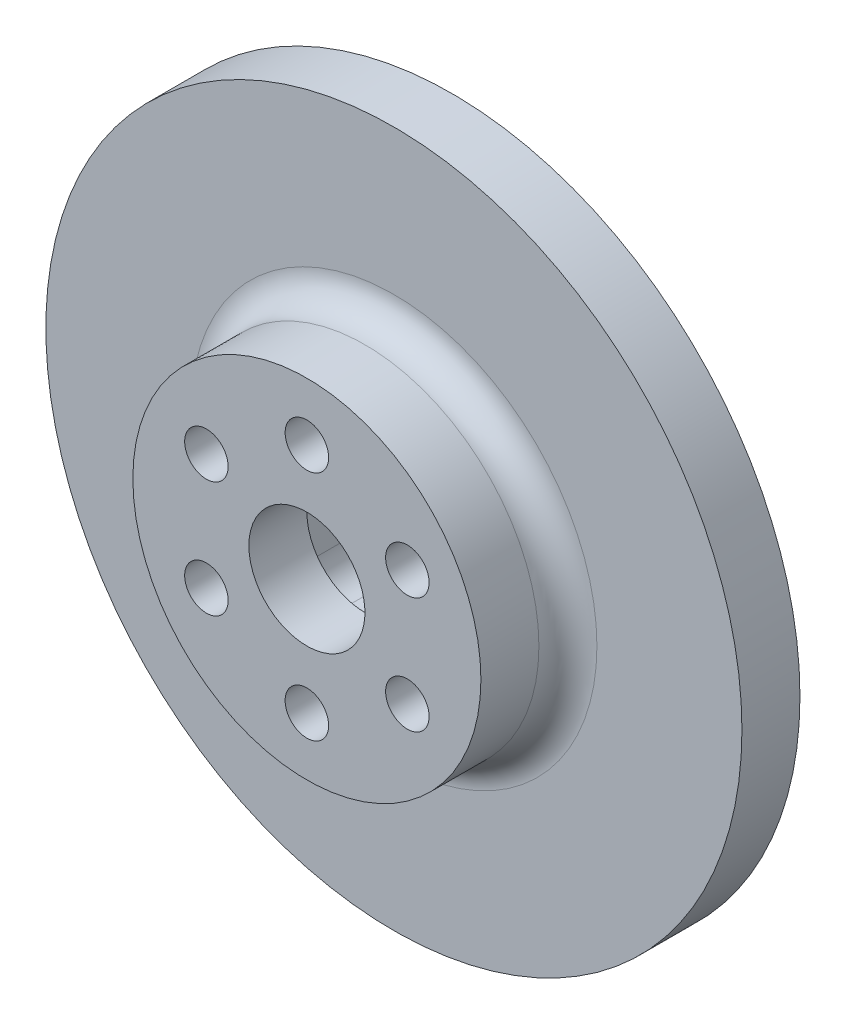
ISO-10303-21;
HEADER;
FILE_DESCRIPTION(('STEP AP214'),'2;1');
FILE_NAME('part.step','',(''),(''),'','','');
FILE_SCHEMA(('AUTOMOTIVE_DESIGN { 1 0 10303 214 1 1 1 1 }'));
ENDSEC;
DATA;
#1=APPLICATION_CONTEXT('core data for automotive mechanical design processes');
#2=APPLICATION_PROTOCOL_DEFINITION('international standard','automotive_design',2000,#1);
#3=PRODUCT_CONTEXT('',#1,'mechanical');
#4=PRODUCT('Part','Part','',(#3));
#5=PRODUCT_RELATED_PRODUCT_CATEGORY('part','',(#4));
#6=PRODUCT_DEFINITION_FORMATION('','',#4);
#7=PRODUCT_DEFINITION_CONTEXT('part definition',#1,'design');
#8=PRODUCT_DEFINITION('design','',#6,#7);
#9=PRODUCT_DEFINITION_SHAPE('','',#8);
#10=(LENGTH_UNIT() NAMED_UNIT(*) SI_UNIT(.MILLI.,.METRE.));
#11=(NAMED_UNIT(*) PLANE_ANGLE_UNIT() SI_UNIT($,.RADIAN.));
#12=(NAMED_UNIT(*) SI_UNIT($,.STERADIAN.) SOLID_ANGLE_UNIT());
#13=UNCERTAINTY_MEASURE_WITH_UNIT(LENGTH_MEASURE(1.E-05),#10,'distance_accuracy_value','');
#14=(GEOMETRIC_REPRESENTATION_CONTEXT(3) GLOBAL_UNCERTAINTY_ASSIGNED_CONTEXT((#13)) GLOBAL_UNIT_ASSIGNED_CONTEXT((#10,
#11,#12)) REPRESENTATION_CONTEXT('',''));
#15=CARTESIAN_POINT('',(0.,0.,0.));
#16=DIRECTION('',(0.,0.,1.));
#17=DIRECTION('',(1.,0.,0.));
#18=AXIS2_PLACEMENT_3D('',#15,#16,#17);
#19=CARTESIAN_POINT('',(0.,0.,6.35));
#20=DIRECTION('',(0.,0.,-1.));
#21=DIRECTION('',(-1.,0.,0.));
#22=AXIS2_PLACEMENT_3D('',#19,#20,#21);
#23=CYLINDRICAL_SURFACE('',#22,38.1);
#24=CARTESIAN_POINT('',(0.,0.,6.35));
#25=DIRECTION('',(0.,0.,1.));
#26=DIRECTION('',(1.,0.,0.));
#27=AXIS2_PLACEMENT_3D('',#24,#25,#26);
#28=CIRCLE('',#27,38.1);
#29=CARTESIAN_POINT('',(38.1,0.,6.35));
#30=VERTEX_POINT('',#29);
#31=EDGE_CURVE('E161',#30,#30,#28,.T.);
#32=ORIENTED_EDGE('',*,*,#31,.F.);
#33=EDGE_LOOP('',(#32));
#34=FACE_BOUND('',#33,.T.);
#35=CARTESIAN_POINT('',(0.,0.,0.));
#36=DIRECTION('',(0.,0.,1.));
#37=DIRECTION('',(1.,0.,0.));
#38=AXIS2_PLACEMENT_3D('',#35,#36,#37);
#39=CIRCLE('',#38,38.1);
#40=CARTESIAN_POINT('',(38.1,0.,0.));
#41=VERTEX_POINT('',#40);
#42=EDGE_CURVE('E160',#41,#41,#39,.T.);
#43=ORIENTED_EDGE('',*,*,#42,.T.);
#44=EDGE_LOOP('',(#43));
#45=FACE_BOUND('',#44,.T.);
#46=ADVANCED_FACE('F36',(#34,#45),#23,.T.);
#47=CARTESIAN_POINT('',(0.,0.,6.35));
#48=DIRECTION('',(0.,0.,1.));
#49=DIRECTION('',(1.,0.,0.));
#50=AXIS2_PLACEMENT_3D('',#47,#48,#49);
#51=PLANE('',#50);
#52=CARTESIAN_POINT('',(0.,-1.01618563327441E-13,6.35));
#53=DIRECTION('',(0.,0.,1.));
#54=DIRECTION('',(1.,0.,0.));
#55=AXIS2_PLACEMENT_3D('',#52,#53,#54);
#56=CIRCLE('',#55,22.225);
#57=CARTESIAN_POINT('',(22.225,-1.01618563327441E-13,6.35));
#58=VERTEX_POINT('',#57);
#59=EDGE_CURVE('E11',#58,#58,#56,.F.);
#60=ORIENTED_EDGE('',*,*,#59,.T.);
#61=EDGE_LOOP('',(#60));
#62=FACE_BOUND('',#61,.T.);
#63=ORIENTED_EDGE('',*,*,#31,.T.);
#64=EDGE_LOOP('',(#63));
#65=FACE_BOUND('',#64,.T.);
#66=ADVANCED_FACE('F187',(#62,#65),#51,.T.);
#67=CARTESIAN_POINT('',(0.,0.,0.));
#68=DIRECTION('',(0.,0.,1.));
#69=DIRECTION('',(1.,0.,0.));
#70=AXIS2_PLACEMENT_3D('',#67,#68,#69);
#71=PLANE('',#70);
#72=DIRECTION('',(-1.,0.,0.));
#73=VECTOR('',#72,1.);
#74=CARTESIAN_POINT('',(4.7625,-9.525,0.));
#75=LINE('',#74,#73);
#76=CARTESIAN_POINT('',(4.7625,-9.525,0.));
#77=VERTEX_POINT('',#76);
#78=CARTESIAN_POINT('',(-4.7625,-9.525,0.));
#79=VERTEX_POINT('',#78);
#80=EDGE_CURVE('E117',#77,#79,#75,.T.);
#81=ORIENTED_EDGE('',*,*,#80,.F.);
#82=CARTESIAN_POINT('',(4.7625,-6.35,0.));
#83=DIRECTION('',(0.,0.,-1.));
#84=DIRECTION('',(1.,0.,0.));
#85=AXIS2_PLACEMENT_3D('',#82,#83,#84);
#86=CIRCLE('',#85,3.175);
#87=CARTESIAN_POINT('',(7.9375,-6.35,0.));
#88=VERTEX_POINT('',#87);
#89=EDGE_CURVE('E51',#88,#77,#86,.T.);
#90=ORIENTED_EDGE('',*,*,#89,.F.);
#91=DIRECTION('',(0.,-1.,0.));
#92=VECTOR('',#91,1.);
#93=CARTESIAN_POINT('',(7.9375,-6.35,0.));
#94=LINE('',#93,#92);
#95=CARTESIAN_POINT('',(7.9375,6.35,0.));
#96=VERTEX_POINT('',#95);
#97=EDGE_CURVE('E139',#96,#88,#94,.T.);
#98=ORIENTED_EDGE('',*,*,#97,.F.);
#99=CARTESIAN_POINT('',(4.7625,6.35,0.));
#100=DIRECTION('',(0.,0.,-1.));
#101=DIRECTION('',(1.,0.,0.));
#102=AXIS2_PLACEMENT_3D('',#99,#100,#101);
#103=CIRCLE('',#102,3.175);
#104=CARTESIAN_POINT('',(4.7625,9.525,0.));
#105=VERTEX_POINT('',#104);
#106=EDGE_CURVE('E136',#105,#96,#103,.T.);
#107=ORIENTED_EDGE('',*,*,#106,.F.);
#108=DIRECTION('',(1.,0.,0.));
#109=VECTOR('',#108,1.);
#110=CARTESIAN_POINT('',(4.7625,9.525,0.));
#111=LINE('',#110,#109);
#112=CARTESIAN_POINT('',(-4.7625,9.525,0.));
#113=VERTEX_POINT('',#112);
#114=EDGE_CURVE('E133',#113,#105,#111,.T.);
#115=ORIENTED_EDGE('',*,*,#114,.F.);
#116=CARTESIAN_POINT('',(-4.7625,6.35,0.));
#117=DIRECTION('',(0.,0.,-1.));
#118=DIRECTION('',(1.,0.,0.));
#119=AXIS2_PLACEMENT_3D('',#116,#117,#118);
#120=CIRCLE('',#119,3.175);
#121=CARTESIAN_POINT('',(-7.9375,6.35,0.));
#122=VERTEX_POINT('',#121);
#123=EDGE_CURVE('E127',#122,#113,#120,.T.);
#124=ORIENTED_EDGE('',*,*,#123,.F.);
#125=DIRECTION('',(0.,1.,0.));
#126=VECTOR('',#125,1.);
#127=CARTESIAN_POINT('',(-7.9375,-6.35,0.));
#128=LINE('',#127,#126);
#129=CARTESIAN_POINT('',(-7.9375,-6.35,0.));
#130=VERTEX_POINT('',#129);
#131=EDGE_CURVE('E125',#130,#122,#128,.T.);
#132=ORIENTED_EDGE('',*,*,#131,.F.);
#133=CARTESIAN_POINT('',(-4.7625,-6.35,0.));
#134=DIRECTION('',(0.,0.,-1.));
#135=DIRECTION('',(-1.,0.,0.));
#136=AXIS2_PLACEMENT_3D('',#133,#134,#135);
#137=CIRCLE('',#136,3.175);
#138=EDGE_CURVE('E108',#79,#130,#137,.T.);
#139=ORIENTED_EDGE('',*,*,#138,.F.);
#140=EDGE_LOOP('',(#81,#90,#98,#107,#115,#124,#132,#139));
#141=FACE_BOUND('',#140,.T.);
#142=ORIENTED_EDGE('',*,*,#42,.F.);
#143=EDGE_LOOP('',(#142));
#144=FACE_BOUND('',#143,.T.);
#145=ADVANCED_FACE('F121',(#141,#144),#71,.F.);
#146=CARTESIAN_POINT('',(0.,-1.01618563327441E-13,69.7565367264149));
#147=DIRECTION('',(0.,0.,-1.));
#148=DIRECTION('',(-1.,0.,0.));
#149=AXIS2_PLACEMENT_3D('',#146,#147,#148);
#150=CYLINDRICAL_SURFACE('',#149,19.05);
#151=CARTESIAN_POINT('',(0.,-1.01618563327441E-13,9.525));
#152=DIRECTION('',(0.,0.,1.));
#153=DIRECTION('',(1.,0.,0.));
#154=AXIS2_PLACEMENT_3D('',#151,#152,#153);
#155=CIRCLE('',#154,19.05);
#156=CARTESIAN_POINT('',(19.05,-1.01618563327441E-13,9.525));
#157=VERTEX_POINT('',#156);
#158=EDGE_CURVE('E44',#157,#157,#155,.T.);
#159=ORIENTED_EDGE('',*,*,#158,.T.);
#160=EDGE_LOOP('',(#159));
#161=FACE_BOUND('',#160,.T.);
#162=CARTESIAN_POINT('',(0.,-1.01618563327441E-13,15.875));
#163=DIRECTION('',(0.,0.,1.));
#164=DIRECTION('',(1.,0.,0.));
#165=AXIS2_PLACEMENT_3D('',#162,#163,#164);
#166=CIRCLE('',#165,19.05);
#167=CARTESIAN_POINT('',(19.05,-1.01618563327441E-13,15.875));
#168=VERTEX_POINT('',#167);
#169=EDGE_CURVE('E156',#168,#168,#166,.T.);
#170=ORIENTED_EDGE('',*,*,#169,.F.);
#171=EDGE_LOOP('',(#170));
#172=FACE_BOUND('',#171,.T.);
#173=ADVANCED_FACE('F168',(#161,#172),#150,.T.);
#174=CARTESIAN_POINT('',(-3.1245635993597E-13,-232.41,15.8749999999999));
#175=DIRECTION('',(0.,0.,1.));
#176=DIRECTION('',(1.,0.,0.));
#177=AXIS2_PLACEMENT_3D('',#174,#175,#176);
#178=PLANE('',#177);
#179=CARTESIAN_POINT('',(0.,12.6999999999998,15.875));
#180=DIRECTION('',(0.,0.,1.));
#181=DIRECTION('',(1.,0.,0.));
#182=AXIS2_PLACEMENT_3D('',#179,#180,#181);
#183=CIRCLE('',#182,2.38125);
#184=CARTESIAN_POINT('',(2.38124999999999,12.6999999999998,15.875));
#185=VERTEX_POINT('',#184);
#186=EDGE_CURVE('E282',#185,#185,#183,.T.);
#187=ORIENTED_EDGE('',*,*,#186,.F.);
#188=EDGE_LOOP('',(#187));
#189=FACE_BOUND('',#188,.T.);
#190=CARTESIAN_POINT('',(-10.9985226280621,6.34999999999997,15.875));
#191=DIRECTION('',(0.,0.,1.));
#192=DIRECTION('',(1.,0.,0.));
#193=AXIS2_PLACEMENT_3D('',#190,#191,#192);
#194=CIRCLE('',#193,2.38125000000212);
#195=CARTESIAN_POINT('',(-8.61727262805997,6.34999999999997,15.875));
#196=VERTEX_POINT('',#195);
#197=EDGE_CURVE('E295',#196,#196,#194,.T.);
#198=ORIENTED_EDGE('',*,*,#197,.F.);
#199=EDGE_LOOP('',(#198));
#200=FACE_BOUND('',#199,.T.);
#201=CARTESIAN_POINT('',(-10.9985226280621,-6.34999999999967,15.875));
#202=DIRECTION('',(0.,0.,1.));
#203=DIRECTION('',(1.,0.,0.));
#204=AXIS2_PLACEMENT_3D('',#201,#202,#203);
#205=CIRCLE('',#204,2.3812500000128);
#206=CARTESIAN_POINT('',(-8.6172726280493,-6.34999999999967,15.875));
#207=VERTEX_POINT('',#206);
#208=EDGE_CURVE('E294',#207,#207,#205,.T.);
#209=ORIENTED_EDGE('',*,*,#208,.F.);
#210=EDGE_LOOP('',(#209));
#211=FACE_BOUND('',#210,.T.);
#212=CARTESIAN_POINT('',(0.,-12.6999999999995,15.875));
#213=DIRECTION('',(0.,0.,1.));
#214=DIRECTION('',(1.,0.,0.));
#215=AXIS2_PLACEMENT_3D('',#212,#213,#214);
#216=CIRCLE('',#215,2.38125000002138);
#217=CARTESIAN_POINT('',(2.38125000002134,-12.6999999999995,15.875));
#218=VERTEX_POINT('',#217);
#219=EDGE_CURVE('E312',#218,#218,#216,.T.);
#220=ORIENTED_EDGE('',*,*,#219,.F.);
#221=EDGE_LOOP('',(#220));
#222=FACE_BOUND('',#221,.T.);
#223=CARTESIAN_POINT('',(10.998522628062,-6.34999999999969,15.875));
#224=DIRECTION('',(0.,0.,1.));
#225=DIRECTION('',(1.,0.,0.));
#226=AXIS2_PLACEMENT_3D('',#223,#224,#225);
#227=CIRCLE('',#226,2.38125000001927);
#228=CARTESIAN_POINT('',(13.3797726280813,-6.34999999999969,15.875));
#229=VERTEX_POINT('',#228);
#230=EDGE_CURVE('E306',#229,#229,#227,.T.);
#231=ORIENTED_EDGE('',*,*,#230,.F.);
#232=EDGE_LOOP('',(#231));
#233=FACE_BOUND('',#232,.T.);
#234=CARTESIAN_POINT('',(10.998522628062,6.34999999999995,15.875));
#235=DIRECTION('',(0.,0.,1.));
#236=DIRECTION('',(1.,0.,0.));
#237=AXIS2_PLACEMENT_3D('',#234,#235,#236);
#238=CIRCLE('',#237,2.38125000000858);
#239=CARTESIAN_POINT('',(13.3797726280706,6.34999999999995,15.875));
#240=VERTEX_POINT('',#239);
#241=EDGE_CURVE('E300',#240,#240,#238,.T.);
#242=ORIENTED_EDGE('',*,*,#241,.F.);
#243=EDGE_LOOP('',(#242));
#244=FACE_BOUND('',#243,.T.);
#245=CARTESIAN_POINT('',(0.,1.42713537823228E-13,15.8750000000001));
#246=DIRECTION('',(0.,0.,-1.));
#247=DIRECTION('',(-1.,0.,0.));
#248=AXIS2_PLACEMENT_3D('',#245,#246,#247);
#249=CIRCLE('',#248,6.34999999999991);
#250=CARTESIAN_POINT('',(-6.34999999999993,1.42713537823228E-13,15.875));
#251=VERTEX_POINT('',#250);
#252=EDGE_CURVE('E285',#251,#251,#249,.T.);
#253=ORIENTED_EDGE('',*,*,#252,.T.);
#254=EDGE_LOOP('',(#253));
#255=FACE_BOUND('',#254,.T.);
#256=ORIENTED_EDGE('',*,*,#169,.T.);
#257=EDGE_LOOP('',(#256));
#258=FACE_BOUND('',#257,.T.);
#259=ADVANCED_FACE('F199',(#189,#200,#211,#222,#233,#244,#255,#258),#178,.T.);
#260=CARTESIAN_POINT('',(4.7625,-6.35,34.3225427210037));
#261=DIRECTION('',(0.,0.,-1.));
#262=DIRECTION('',(-1.,0.,0.));
#263=AXIS2_PLACEMENT_3D('',#260,#261,#262);
#264=CYLINDRICAL_SURFACE('',#263,3.175);
#265=CARTESIAN_POINT('',(4.7625,-6.35,9.52500000000003));
#266=DIRECTION('',(0.,0.,-1.));
#267=DIRECTION('',(-1.,0.,0.));
#268=AXIS2_PLACEMENT_3D('',#265,#266,#267);
#269=CIRCLE('',#268,3.175);
#270=CARTESIAN_POINT('',(4.7625,-9.525,9.52500000000003));
#271=VERTEX_POINT('',#270);
#272=CARTESIAN_POINT('',(7.9375,-6.35,9.52500000000003));
#273=VERTEX_POINT('',#272);
#274=EDGE_CURVE('E157',#271,#273,#269,.F.);
#275=ORIENTED_EDGE('',*,*,#274,.T.);
#276=DIRECTION('',(0.,0.,-1.));
#277=VECTOR('',#276,1.);
#278=CARTESIAN_POINT('',(7.9375,-6.35,34.3225427210037));
#279=LINE('',#278,#277);
#280=EDGE_CURVE('E142',#273,#88,#279,.T.);
#281=ORIENTED_EDGE('',*,*,#280,.T.);
#282=ORIENTED_EDGE('',*,*,#89,.T.);
#283=DIRECTION('',(0.,0.,-1.));
#284=VECTOR('',#283,1.);
#285=CARTESIAN_POINT('',(4.7625,-9.525,34.3225427210037));
#286=LINE('',#285,#284);
#287=EDGE_CURVE('E114',#271,#77,#286,.T.);
#288=ORIENTED_EDGE('',*,*,#287,.F.);
#289=EDGE_LOOP('',(#275,#281,#282,#288));
#290=FACE_BOUND('',#289,.T.);
#291=ADVANCED_FACE('F202',(#290),#264,.F.);
#292=CARTESIAN_POINT('',(7.9375,-6.35,34.3225427210037));
#293=DIRECTION('',(1.,0.,0.));
#294=DIRECTION('',(0.,1.,0.));
#295=AXIS2_PLACEMENT_3D('',#292,#293,#294);
#296=PLANE('',#295);
#297=DIRECTION('',(0.,1.,0.));
#298=VECTOR('',#297,1.);
#299=CARTESIAN_POINT('',(7.9375,-6.35000000000002,9.52500000000003));
#300=LINE('',#299,#298);
#301=CARTESIAN_POINT('',(7.9375,6.35,9.52500000000002));
#302=VERTEX_POINT('',#301);
#303=EDGE_CURVE('E330',#273,#302,#300,.T.);
#304=ORIENTED_EDGE('',*,*,#303,.T.);
#305=DIRECTION('',(0.,0.,-1.));
#306=VECTOR('',#305,1.);
#307=CARTESIAN_POINT('',(7.9375,6.35,34.3225427210037));
#308=LINE('',#307,#306);
#309=EDGE_CURVE('E144',#302,#96,#308,.T.);
#310=ORIENTED_EDGE('',*,*,#309,.T.);
#311=ORIENTED_EDGE('',*,*,#97,.T.);
#312=ORIENTED_EDGE('',*,*,#280,.F.);
#313=EDGE_LOOP('',(#304,#310,#311,#312));
#314=FACE_BOUND('',#313,.T.);
#315=ADVANCED_FACE('F208',(#314),#296,.F.);
#316=CARTESIAN_POINT('',(4.7625,6.35,34.3225427210037));
#317=DIRECTION('',(0.,0.,-1.));
#318=DIRECTION('',(-1.,0.,0.));
#319=AXIS2_PLACEMENT_3D('',#316,#317,#318);
#320=CYLINDRICAL_SURFACE('',#319,3.175);
#321=CARTESIAN_POINT('',(4.7625,6.35,9.52500000000002));
#322=DIRECTION('',(0.,0.,-1.));
#323=DIRECTION('',(-1.,0.,0.));
#324=AXIS2_PLACEMENT_3D('',#321,#322,#323);
#325=CIRCLE('',#324,3.175);
#326=CARTESIAN_POINT('',(4.7625,9.525,9.52500000000002));
#327=VERTEX_POINT('',#326);
#328=EDGE_CURVE('E328',#302,#327,#325,.F.);
#329=ORIENTED_EDGE('',*,*,#328,.T.);
#330=DIRECTION('',(0.,0.,-1.));
#331=VECTOR('',#330,1.);
#332=CARTESIAN_POINT('',(4.7625,9.525,34.3225427210037));
#333=LINE('',#332,#331);
#334=EDGE_CURVE('E146',#327,#105,#333,.T.);
#335=ORIENTED_EDGE('',*,*,#334,.T.);
#336=ORIENTED_EDGE('',*,*,#106,.T.);
#337=ORIENTED_EDGE('',*,*,#309,.F.);
#338=EDGE_LOOP('',(#329,#335,#336,#337));
#339=FACE_BOUND('',#338,.T.);
#340=ADVANCED_FACE('F223',(#339),#320,.F.);
#341=CARTESIAN_POINT('',(4.7625,9.525,34.3225427210037));
#342=DIRECTION('',(0.,1.,0.));
#343=DIRECTION('',(-1.,0.,0.));
#344=AXIS2_PLACEMENT_3D('',#341,#342,#343);
#345=PLANE('',#344);
#346=DIRECTION('',(-1.,0.,0.));
#347=VECTOR('',#346,1.);
#348=CARTESIAN_POINT('',(4.76250000000003,9.525,9.52500000000002));
#349=LINE('',#348,#347);
#350=CARTESIAN_POINT('',(-4.7625,9.525,9.52500000000001));
#351=VERTEX_POINT('',#350);
#352=EDGE_CURVE('E326',#327,#351,#349,.T.);
#353=ORIENTED_EDGE('',*,*,#352,.T.);
#354=DIRECTION('',(0.,0.,-1.));
#355=VECTOR('',#354,1.);
#356=CARTESIAN_POINT('',(-4.7625,9.525,34.3225427210037));
#357=LINE('',#356,#355);
#358=EDGE_CURVE('E148',#351,#113,#357,.T.);
#359=ORIENTED_EDGE('',*,*,#358,.T.);
#360=ORIENTED_EDGE('',*,*,#114,.T.);
#361=ORIENTED_EDGE('',*,*,#334,.F.);
#362=EDGE_LOOP('',(#353,#359,#360,#361));
#363=FACE_BOUND('',#362,.T.);
#364=ADVANCED_FACE('F219',(#363),#345,.F.);
#365=CARTESIAN_POINT('',(-4.7625,6.35,34.3225427210037));
#366=DIRECTION('',(0.,0.,-1.));
#367=DIRECTION('',(-1.,0.,0.));
#368=AXIS2_PLACEMENT_3D('',#365,#366,#367);
#369=CYLINDRICAL_SURFACE('',#368,3.175);
#370=CARTESIAN_POINT('',(-4.7625,6.35,9.52500000000001));
#371=DIRECTION('',(0.,0.,-1.));
#372=DIRECTION('',(-1.,0.,0.));
#373=AXIS2_PLACEMENT_3D('',#370,#371,#372);
#374=CIRCLE('',#373,3.175);
#375=CARTESIAN_POINT('',(-7.9375,6.35,9.525));
#376=VERTEX_POINT('',#375);
#377=EDGE_CURVE('E324',#351,#376,#374,.F.);
#378=ORIENTED_EDGE('',*,*,#377,.T.);
#379=DIRECTION('',(0.,0.,-1.));
#380=VECTOR('',#379,1.);
#381=CARTESIAN_POINT('',(-7.9375,6.35,34.3225427210037));
#382=LINE('',#381,#380);
#383=EDGE_CURVE('E150',#376,#122,#382,.T.);
#384=ORIENTED_EDGE('',*,*,#383,.T.);
#385=ORIENTED_EDGE('',*,*,#123,.T.);
#386=ORIENTED_EDGE('',*,*,#358,.F.);
#387=EDGE_LOOP('',(#378,#384,#385,#386));
#388=FACE_BOUND('',#387,.T.);
#389=ADVANCED_FACE('F216',(#388),#369,.F.);
#390=CARTESIAN_POINT('',(-7.9375,-6.35,34.3225427210037));
#391=DIRECTION('',(-1.,0.,0.));
#392=DIRECTION('',(0.,0.,1.));
#393=AXIS2_PLACEMENT_3D('',#390,#391,#392);
#394=PLANE('',#393);
#395=DIRECTION('',(0.,-1.,0.));
#396=VECTOR('',#395,1.);
#397=CARTESIAN_POINT('',(-7.9375,-6.35000000000002,9.52500000000001));
#398=LINE('',#397,#396);
#399=CARTESIAN_POINT('',(-7.9375,-6.35,9.52500000000001));
#400=VERTEX_POINT('',#399);
#401=EDGE_CURVE('E59',#376,#400,#398,.T.);
#402=ORIENTED_EDGE('',*,*,#401,.T.);
#403=DIRECTION('',(0.,0.,-1.));
#404=VECTOR('',#403,1.);
#405=CARTESIAN_POINT('',(-7.9375,-6.35,34.3225427210037));
#406=LINE('',#405,#404);
#407=EDGE_CURVE('E113',#400,#130,#406,.T.);
#408=ORIENTED_EDGE('',*,*,#407,.T.);
#409=ORIENTED_EDGE('',*,*,#131,.T.);
#410=ORIENTED_EDGE('',*,*,#383,.F.);
#411=EDGE_LOOP('',(#402,#408,#409,#410));
#412=FACE_BOUND('',#411,.T.);
#413=ADVANCED_FACE('F213',(#412),#394,.F.);
#414=CARTESIAN_POINT('',(-4.7625,-6.35,34.3225427210037));
#415=DIRECTION('',(0.,0.,-1.));
#416=DIRECTION('',(-1.,0.,0.));
#417=AXIS2_PLACEMENT_3D('',#414,#415,#416);
#418=CYLINDRICAL_SURFACE('',#417,3.175);
#419=CARTESIAN_POINT('',(-4.7625,-6.35,9.52500000000002));
#420=DIRECTION('',(0.,0.,-1.));
#421=DIRECTION('',(-1.,0.,0.));
#422=AXIS2_PLACEMENT_3D('',#419,#420,#421);
#423=CIRCLE('',#422,3.175);
#424=CARTESIAN_POINT('',(-4.7625,-9.525,9.52500000000003));
#425=VERTEX_POINT('',#424);
#426=EDGE_CURVE('E110',#400,#425,#423,.F.);
#427=ORIENTED_EDGE('',*,*,#426,.T.);
#428=DIRECTION('',(0.,0.,-1.));
#429=VECTOR('',#428,1.);
#430=CARTESIAN_POINT('',(-4.7625,-9.525,34.3225427210037));
#431=LINE('',#430,#429);
#432=EDGE_CURVE('E103',#425,#79,#431,.T.);
#433=ORIENTED_EDGE('',*,*,#432,.T.);
#434=ORIENTED_EDGE('',*,*,#138,.T.);
#435=ORIENTED_EDGE('',*,*,#407,.F.);
#436=EDGE_LOOP('',(#427,#433,#434,#435));
#437=FACE_BOUND('',#436,.T.);
#438=ADVANCED_FACE('F105',(#437),#418,.F.);
#439=CARTESIAN_POINT('',(4.7625,-9.525,34.3225427210037));
#440=DIRECTION('',(0.,-1.,0.));
#441=DIRECTION('',(1.,0.,0.));
#442=AXIS2_PLACEMENT_3D('',#439,#440,#441);
#443=PLANE('',#442);
#444=DIRECTION('',(1.,0.,0.));
#445=VECTOR('',#444,1.);
#446=CARTESIAN_POINT('',(4.76250000000003,-9.525,9.52500000000003));
#447=LINE('',#446,#445);
#448=EDGE_CURVE('E154',#425,#271,#447,.T.);
#449=ORIENTED_EDGE('',*,*,#448,.T.);
#450=ORIENTED_EDGE('',*,*,#287,.T.);
#451=ORIENTED_EDGE('',*,*,#80,.T.);
#452=ORIENTED_EDGE('',*,*,#432,.F.);
#453=EDGE_LOOP('',(#449,#450,#451,#452));
#454=FACE_BOUND('',#453,.T.);
#455=ADVANCED_FACE('F118',(#454),#443,.F.);
#456=CARTESIAN_POINT('',(-3.04980223802884E-13,-232.41,9.52500000000017));
#457=DIRECTION('',(0.,0.,-1.));
#458=DIRECTION('',(0.,-1.,0.));
#459=AXIS2_PLACEMENT_3D('',#456,#457,#458);
#460=PLANE('',#459);
#461=CARTESIAN_POINT('',(0.,1.45117997095982E-13,9.52500000000002));
#462=DIRECTION('',(0.,0.,-1.));
#463=DIRECTION('',(-1.,0.,0.));
#464=AXIS2_PLACEMENT_3D('',#461,#462,#463);
#465=CIRCLE('',#464,6.34999999999991);
#466=CARTESIAN_POINT('',(-6.34999999999993,1.45117997095982E-13,9.52500000000001));
#467=VERTEX_POINT('',#466);
#468=EDGE_CURVE('E281',#467,#467,#465,.T.);
#469=ORIENTED_EDGE('',*,*,#468,.F.);
#470=EDGE_LOOP('',(#469));
#471=FACE_BOUND('',#470,.T.);
#472=ORIENTED_EDGE('',*,*,#274,.F.);
#473=ORIENTED_EDGE('',*,*,#448,.F.);
#474=ORIENTED_EDGE('',*,*,#426,.F.);
#475=ORIENTED_EDGE('',*,*,#401,.F.);
#476=ORIENTED_EDGE('',*,*,#377,.F.);
#477=ORIENTED_EDGE('',*,*,#352,.F.);
#478=ORIENTED_EDGE('',*,*,#328,.F.);
#479=ORIENTED_EDGE('',*,*,#303,.F.);
#480=EDGE_LOOP('',(#472,#473,#474,#475,#476,#477,#478,#479));
#481=FACE_BOUND('',#480,.T.);
#482=ADVANCED_FACE('F182',(#471,#481),#460,.T.);
#483=CARTESIAN_POINT('',(0.,1.42713537823228E-13,15.8750000000001));
#484=DIRECTION('',(0.,0.,-1.));
#485=DIRECTION('',(-1.,0.,0.));
#486=AXIS2_PLACEMENT_3D('',#483,#484,#485);
#487=CYLINDRICAL_SURFACE('',#486,6.34999999999991);
#488=ORIENTED_EDGE('',*,*,#252,.F.);
#489=EDGE_LOOP('',(#488));
#490=FACE_BOUND('',#489,.T.);
#491=ORIENTED_EDGE('',*,*,#468,.T.);
#492=EDGE_LOOP('',(#491));
#493=FACE_BOUND('',#492,.T.);
#494=ADVANCED_FACE('F173',(#490,#493),#487,.F.);
#495=CARTESIAN_POINT('',(0.,-1.01618563327441E-13,9.525));
#496=DIRECTION('',(0.,0.,1.));
#497=DIRECTION('',(1.,0.,0.));
#498=AXIS2_PLACEMENT_3D('',#495,#496,#497);
#499=TOROIDAL_SURFACE('',#498,22.225,3.175);
#500=ORIENTED_EDGE('',*,*,#59,.F.);
#501=EDGE_LOOP('',(#500));
#502=FACE_BOUND('',#501,.T.);
#503=ORIENTED_EDGE('',*,*,#158,.F.);
#504=EDGE_LOOP('',(#503));
#505=FACE_BOUND('',#504,.T.);
#506=ADVANCED_FACE('F38',(#502,#505),#499,.F.);
#507=CARTESIAN_POINT('',(10.998522628062,6.34999999999995,9.52499999999998));
#508=DIRECTION('',(0.,0.,1.));
#509=DIRECTION('',(1.,0.,0.));
#510=AXIS2_PLACEMENT_3D('',#507,#508,#509);
#511=CYLINDRICAL_SURFACE('',#510,2.38125000000858);
#512=CARTESIAN_POINT('',(10.998522628062,6.34999999999995,9.52499999999998));
#513=DIRECTION('',(0.,0.,1.));
#514=DIRECTION('',(1.,0.,0.));
#515=AXIS2_PLACEMENT_3D('',#512,#513,#514);
#516=CIRCLE('',#515,2.38125000000858);
#517=CARTESIAN_POINT('',(13.3797726280706,6.34999999999995,9.52499999999998));
#518=VERTEX_POINT('',#517);
#519=EDGE_CURVE('E288',#518,#518,#516,.T.);
#520=ORIENTED_EDGE('',*,*,#519,.F.);
#521=EDGE_LOOP('',(#520));
#522=FACE_BOUND('',#521,.T.);
#523=ORIENTED_EDGE('',*,*,#241,.T.);
#524=EDGE_LOOP('',(#523));
#525=FACE_BOUND('',#524,.T.);
#526=ADVANCED_FACE('F172',(#522,#525),#511,.F.);
#527=CARTESIAN_POINT('',(10.998522628062,6.34999999999995,9.52499999999998));
#528=DIRECTION('',(0.,0.,1.));
#529=DIRECTION('',(1.,0.,0.));
#530=AXIS2_PLACEMENT_3D('',#527,#528,#529);
#531=PLANE('',#530);
#532=ORIENTED_EDGE('',*,*,#519,.T.);
#533=EDGE_LOOP('',(#532));
#534=FACE_BOUND('',#533,.T.);
#535=ADVANCED_FACE('F179',(#534),#531,.T.);
#536=CARTESIAN_POINT('',(10.998522628062,-6.34999999999969,9.52499999999998));
#537=DIRECTION('',(0.,0.,1.));
#538=DIRECTION('',(1.,0.,0.));
#539=AXIS2_PLACEMENT_3D('',#536,#537,#538);
#540=CYLINDRICAL_SURFACE('',#539,2.38125000001927);
#541=CARTESIAN_POINT('',(10.998522628062,-6.34999999999969,9.52499999999998));
#542=DIRECTION('',(0.,0.,1.));
#543=DIRECTION('',(1.,0.,0.));
#544=AXIS2_PLACEMENT_3D('',#541,#542,#543);
#545=CIRCLE('',#544,2.38125000001927);
#546=CARTESIAN_POINT('',(13.3797726280813,-6.34999999999969,9.52499999999998));
#547=VERTEX_POINT('',#546);
#548=EDGE_CURVE('E303',#547,#547,#545,.T.);
#549=ORIENTED_EDGE('',*,*,#548,.F.);
#550=EDGE_LOOP('',(#549));
#551=FACE_BOUND('',#550,.T.);
#552=ORIENTED_EDGE('',*,*,#230,.T.);
#553=EDGE_LOOP('',(#552));
#554=FACE_BOUND('',#553,.T.);
#555=ADVANCED_FACE('F252',(#551,#554),#540,.F.);
#556=CARTESIAN_POINT('',(10.998522628062,-6.34999999999969,9.52499999999998));
#557=DIRECTION('',(0.,0.,1.));
#558=DIRECTION('',(1.,0.,0.));
#559=AXIS2_PLACEMENT_3D('',#556,#557,#558);
#560=PLANE('',#559);
#561=ORIENTED_EDGE('',*,*,#548,.T.);
#562=EDGE_LOOP('',(#561));
#563=FACE_BOUND('',#562,.T.);
#564=ADVANCED_FACE('F247',(#563),#560,.T.);
#565=CARTESIAN_POINT('',(0.,-12.6999999999995,9.52499999999998));
#566=DIRECTION('',(0.,0.,1.));
#567=DIRECTION('',(1.,0.,0.));
#568=AXIS2_PLACEMENT_3D('',#565,#566,#567);
#569=CYLINDRICAL_SURFACE('',#568,2.38125000002138);
#570=CARTESIAN_POINT('',(0.,-12.6999999999995,9.52499999999998));
#571=DIRECTION('',(0.,0.,1.));
#572=DIRECTION('',(1.,0.,0.));
#573=AXIS2_PLACEMENT_3D('',#570,#571,#572);
#574=CIRCLE('',#573,2.38125000002138);
#575=CARTESIAN_POINT('',(2.38125000002134,-12.6999999999995,9.52499999999998));
#576=VERTEX_POINT('',#575);
#577=EDGE_CURVE('E309',#576,#576,#574,.T.);
#578=ORIENTED_EDGE('',*,*,#577,.F.);
#579=EDGE_LOOP('',(#578));
#580=FACE_BOUND('',#579,.T.);
#581=ORIENTED_EDGE('',*,*,#219,.T.);
#582=EDGE_LOOP('',(#581));
#583=FACE_BOUND('',#582,.T.);
#584=ADVANCED_FACE('F244',(#580,#583),#569,.F.);
#585=CARTESIAN_POINT('',(0.,-12.6999999999995,9.52499999999998));
#586=DIRECTION('',(0.,0.,1.));
#587=DIRECTION('',(1.,0.,0.));
#588=AXIS2_PLACEMENT_3D('',#585,#586,#587);
#589=PLANE('',#588);
#590=ORIENTED_EDGE('',*,*,#577,.T.);
#591=EDGE_LOOP('',(#590));
#592=FACE_BOUND('',#591,.T.);
#593=ADVANCED_FACE('F238',(#592),#589,.T.);
#594=CARTESIAN_POINT('',(-10.9985226280621,-6.34999999999967,9.52499999999998));
#595=DIRECTION('',(0.,0.,1.));
#596=DIRECTION('',(1.,0.,0.));
#597=AXIS2_PLACEMENT_3D('',#594,#595,#596);
#598=CYLINDRICAL_SURFACE('',#597,2.3812500000128);
#599=CARTESIAN_POINT('',(-10.9985226280621,-6.34999999999967,9.52499999999998));
#600=DIRECTION('',(0.,0.,1.));
#601=DIRECTION('',(1.,0.,0.));
#602=AXIS2_PLACEMENT_3D('',#599,#600,#601);
#603=CIRCLE('',#602,2.3812500000128);
#604=CARTESIAN_POINT('',(-8.6172726280493,-6.34999999999967,9.52499999999998));
#605=VERTEX_POINT('',#604);
#606=EDGE_CURVE('E315',#605,#605,#603,.T.);
#607=ORIENTED_EDGE('',*,*,#606,.F.);
#608=EDGE_LOOP('',(#607));
#609=FACE_BOUND('',#608,.T.);
#610=ORIENTED_EDGE('',*,*,#208,.T.);
#611=EDGE_LOOP('',(#610));
#612=FACE_BOUND('',#611,.T.);
#613=ADVANCED_FACE('F234',(#609,#612),#598,.F.);
#614=CARTESIAN_POINT('',(-10.9985226280621,-6.34999999999967,9.52499999999998));
#615=DIRECTION('',(0.,0.,1.));
#616=DIRECTION('',(1.,0.,0.));
#617=AXIS2_PLACEMENT_3D('',#614,#615,#616);
#618=PLANE('',#617);
#619=ORIENTED_EDGE('',*,*,#606,.T.);
#620=EDGE_LOOP('',(#619));
#621=FACE_BOUND('',#620,.T.);
#622=ADVANCED_FACE('F237',(#621),#618,.T.);
#623=CARTESIAN_POINT('',(-10.9985226280621,6.34999999999997,9.52499999999998));
#624=DIRECTION('',(0.,0.,1.));
#625=DIRECTION('',(1.,0.,0.));
#626=AXIS2_PLACEMENT_3D('',#623,#624,#625);
#627=CYLINDRICAL_SURFACE('',#626,2.38125000000212);
#628=CARTESIAN_POINT('',(-10.9985226280621,6.34999999999997,9.52499999999998));
#629=DIRECTION('',(0.,0.,1.));
#630=DIRECTION('',(1.,0.,0.));
#631=AXIS2_PLACEMENT_3D('',#628,#629,#630);
#632=CIRCLE('',#631,2.38125000000212);
#633=CARTESIAN_POINT('',(-8.61727262805997,6.34999999999997,9.52499999999998));
#634=VERTEX_POINT('',#633);
#635=EDGE_CURVE('E291',#634,#634,#632,.T.);
#636=ORIENTED_EDGE('',*,*,#635,.F.);
#637=EDGE_LOOP('',(#636));
#638=FACE_BOUND('',#637,.T.);
#639=ORIENTED_EDGE('',*,*,#197,.T.);
#640=EDGE_LOOP('',(#639));
#641=FACE_BOUND('',#640,.T.);
#642=ADVANCED_FACE('F242',(#638,#641),#627,.F.);
#643=CARTESIAN_POINT('',(-10.9985226280621,6.34999999999997,9.52499999999998));
#644=DIRECTION('',(0.,0.,1.));
#645=DIRECTION('',(1.,0.,0.));
#646=AXIS2_PLACEMENT_3D('',#643,#644,#645);
#647=PLANE('',#646);
#648=ORIENTED_EDGE('',*,*,#635,.T.);
#649=EDGE_LOOP('',(#648));
#650=FACE_BOUND('',#649,.T.);
#651=ADVANCED_FACE('F264',(#650),#647,.T.);
#652=CARTESIAN_POINT('',(0.,12.6999999999998,9.52499999999998));
#653=DIRECTION('',(0.,0.,1.));
#654=DIRECTION('',(1.,0.,0.));
#655=AXIS2_PLACEMENT_3D('',#652,#653,#654);
#656=CYLINDRICAL_SURFACE('',#655,2.38125);
#657=CARTESIAN_POINT('',(0.,12.6999999999998,9.52499999999998));
#658=DIRECTION('',(0.,0.,1.));
#659=DIRECTION('',(1.,0.,0.));
#660=AXIS2_PLACEMENT_3D('',#657,#658,#659);
#661=CIRCLE('',#660,2.38125);
#662=CARTESIAN_POINT('',(2.38124999999999,12.6999999999998,9.52499999999998));
#663=VERTEX_POINT('',#662);
#664=EDGE_CURVE('E280',#663,#663,#661,.T.);
#665=ORIENTED_EDGE('',*,*,#664,.F.);
#666=EDGE_LOOP('',(#665));
#667=FACE_BOUND('',#666,.T.);
#668=ORIENTED_EDGE('',*,*,#186,.T.);
#669=EDGE_LOOP('',(#668));
#670=FACE_BOUND('',#669,.T.);
#671=ADVANCED_FACE('F268',(#667,#670),#656,.F.);
#672=CARTESIAN_POINT('',(0.,12.6999999999998,9.52499999999998));
#673=DIRECTION('',(0.,0.,1.));
#674=DIRECTION('',(1.,0.,0.));
#675=AXIS2_PLACEMENT_3D('',#672,#673,#674);
#676=PLANE('',#675);
#677=ORIENTED_EDGE('',*,*,#664,.T.);
#678=EDGE_LOOP('',(#677));
#679=FACE_BOUND('',#678,.T.);
#680=ADVANCED_FACE('F272',(#679),#676,.T.);
#681=CLOSED_SHELL('',(#46,#66,#145,#173,#259,#291,#315,#340,#364,#389,#413,#438,#455,#482,#494,
#506,#526,#535,#555,#564,#584,#593,#613,#622,#642,#651,#671,#680));
#682=MANIFOLD_SOLID_BREP('B2',#681);
#683=ADVANCED_BREP_SHAPE_REPRESENTATION('',(#18,#682),#14);
#684=SHAPE_DEFINITION_REPRESENTATION(#9,#683);
ENDSEC;
END-ISO-10303-21;
